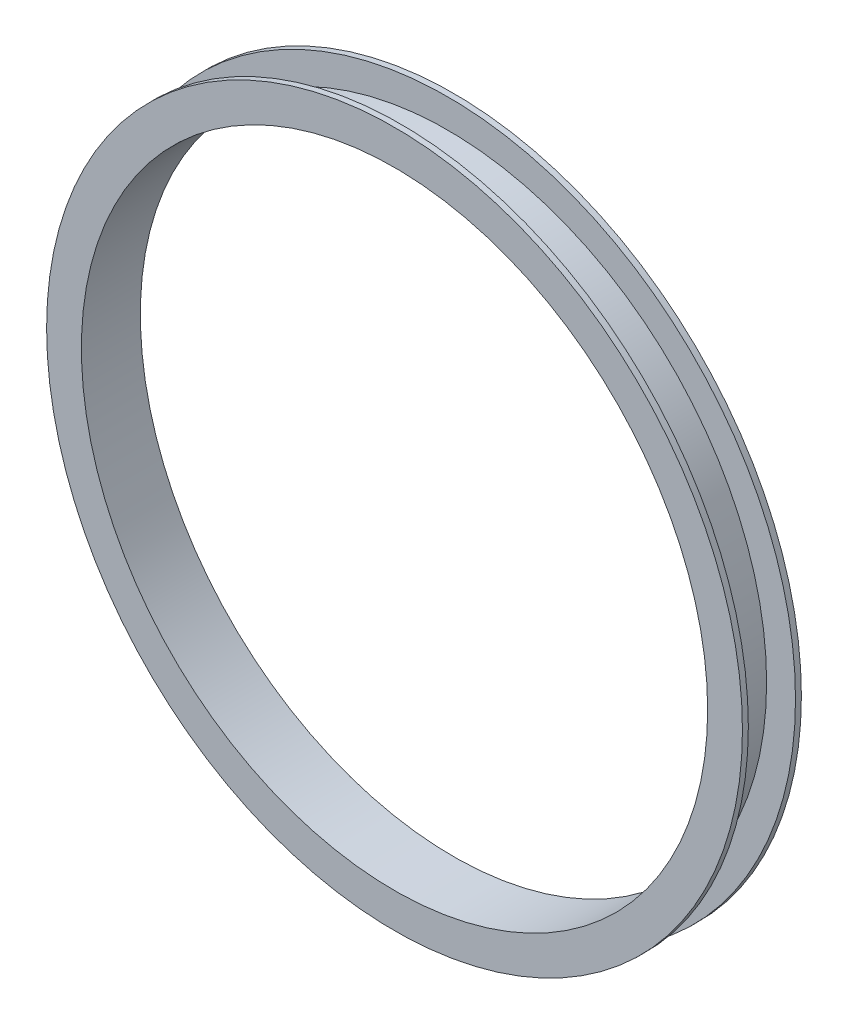
ISO-10303-21;
HEADER;
FILE_DESCRIPTION(('STEP AP214'),'2;1');
FILE_NAME('part.step','',(''),(''),'','','');
FILE_SCHEMA(('AUTOMOTIVE_DESIGN { 1 0 10303 214 1 1 1 1 }'));
ENDSEC;
DATA;
#1=APPLICATION_CONTEXT('core data for automotive mechanical design processes');
#2=APPLICATION_PROTOCOL_DEFINITION('international standard','automotive_design',2000,#1);
#3=PRODUCT_CONTEXT('',#1,'mechanical');
#4=PRODUCT('Part','Part','',(#3));
#5=PRODUCT_RELATED_PRODUCT_CATEGORY('part','',(#4));
#6=PRODUCT_DEFINITION_FORMATION('','',#4);
#7=PRODUCT_DEFINITION_CONTEXT('part definition',#1,'design');
#8=PRODUCT_DEFINITION('design','',#6,#7);
#9=PRODUCT_DEFINITION_SHAPE('','',#8);
#10=(LENGTH_UNIT() NAMED_UNIT(*) SI_UNIT(.MILLI.,.METRE.));
#11=(NAMED_UNIT(*) PLANE_ANGLE_UNIT() SI_UNIT($,.RADIAN.));
#12=(NAMED_UNIT(*) SI_UNIT($,.STERADIAN.) SOLID_ANGLE_UNIT());
#13=UNCERTAINTY_MEASURE_WITH_UNIT(LENGTH_MEASURE(1.E-05),#10,'distance_accuracy_value','');
#14=(GEOMETRIC_REPRESENTATION_CONTEXT(3) GLOBAL_UNCERTAINTY_ASSIGNED_CONTEXT((#13)) GLOBAL_UNIT_ASSIGNED_CONTEXT((#10,
#11,#12)) REPRESENTATION_CONTEXT('',''));
#15=CARTESIAN_POINT('',(0.,0.,0.));
#16=DIRECTION('',(0.,0.,1.));
#17=DIRECTION('',(1.,0.,0.));
#18=AXIS2_PLACEMENT_3D('',#15,#16,#17);
#19=CARTESIAN_POINT('',(0.,0.,3.175));
#20=DIRECTION('',(0.,0.,1.));
#21=DIRECTION('',(1.,0.,0.));
#22=AXIS2_PLACEMENT_3D('',#19,#20,#21);
#23=PLANE('',#22);
#24=CARTESIAN_POINT('',(0.,0.,3.175));
#25=DIRECTION('',(0.,0.,1.));
#26=DIRECTION('',(1.,0.,0.));
#27=AXIS2_PLACEMENT_3D('',#24,#25,#26);
#28=CIRCLE('',#27,187.3885);
#29=CARTESIAN_POINT('',(187.3885,0.,3.175));
#30=VERTEX_POINT('',#29);
#31=EDGE_CURVE('E10',#30,#30,#28,.T.);
#32=ORIENTED_EDGE('',*,*,#31,.T.);
#33=EDGE_LOOP('',(#32));
#34=FACE_BOUND('',#33,.T.);
#35=CARTESIAN_POINT('',(0.,0.,3.175));
#36=DIRECTION('',(0.,0.,1.));
#37=DIRECTION('',(1.,0.,0.));
#38=AXIS2_PLACEMENT_3D('',#35,#36,#37);
#39=CIRCLE('',#38,171.831);
#40=CARTESIAN_POINT('',(171.831,0.,3.175));
#41=VERTEX_POINT('',#40);
#42=EDGE_CURVE('E48',#41,#41,#39,.T.);
#43=ORIENTED_EDGE('',*,*,#42,.F.);
#44=EDGE_LOOP('',(#43));
#45=FACE_BOUND('',#44,.T.);
#46=ADVANCED_FACE('F32',(#34,#45),#23,.T.);
#47=CARTESIAN_POINT('',(0.,0.,0.));
#48=DIRECTION('',(0.,0.,1.));
#49=DIRECTION('',(1.,0.,0.));
#50=AXIS2_PLACEMENT_3D('',#47,#48,#49);
#51=PLANE('',#50);
#52=CARTESIAN_POINT('',(0.,0.,0.));
#53=DIRECTION('',(0.,0.,1.));
#54=DIRECTION('',(1.,0.,0.));
#55=AXIS2_PLACEMENT_3D('',#52,#53,#54);
#56=CIRCLE('',#55,187.3885);
#57=CARTESIAN_POINT('',(187.3885,0.,0.));
#58=VERTEX_POINT('',#57);
#59=EDGE_CURVE('E36',#58,#58,#56,.T.);
#60=ORIENTED_EDGE('',*,*,#59,.F.);
#61=EDGE_LOOP('',(#60));
#62=FACE_BOUND('',#61,.T.);
#63=CARTESIAN_POINT('',(0.,0.,0.));
#64=DIRECTION('',(0.,0.,1.));
#65=DIRECTION('',(1.,0.,0.));
#66=AXIS2_PLACEMENT_3D('',#63,#64,#65);
#67=CIRCLE('',#66,168.656);
#68=CARTESIAN_POINT('',(168.656,0.,0.));
#69=VERTEX_POINT('',#68);
#70=EDGE_CURVE('E43',#69,#69,#67,.T.);
#71=ORIENTED_EDGE('',*,*,#70,.T.);
#72=EDGE_LOOP('',(#71));
#73=FACE_BOUND('',#72,.T.);
#74=ADVANCED_FACE('F81',(#62,#73),#51,.F.);
#75=CARTESIAN_POINT('',(0.,0.,3.175));
#76=DIRECTION('',(0.,0.,-1.));
#77=DIRECTION('',(-1.,0.,0.));
#78=AXIS2_PLACEMENT_3D('',#75,#76,#77);
#79=CYLINDRICAL_SURFACE('',#78,187.3885);
#80=ORIENTED_EDGE('',*,*,#31,.F.);
#81=EDGE_LOOP('',(#80));
#82=FACE_BOUND('',#81,.T.);
#83=ORIENTED_EDGE('',*,*,#59,.T.);
#84=EDGE_LOOP('',(#83));
#85=FACE_BOUND('',#84,.T.);
#86=ADVANCED_FACE('F34',(#82,#85),#79,.T.);
#87=CARTESIAN_POINT('',(0.,0.,3.175));
#88=DIRECTION('',(0.,0.,-1.));
#89=DIRECTION('',(-1.,0.,0.));
#90=AXIS2_PLACEMENT_3D('',#87,#88,#89);
#91=CYLINDRICAL_SURFACE('',#90,168.656);
#92=ORIENTED_EDGE('',*,*,#70,.F.);
#93=EDGE_LOOP('',(#92));
#94=FACE_BOUND('',#93,.T.);
#95=CARTESIAN_POINT('',(0.,0.,31.75));
#96=DIRECTION('',(0.,0.,1.));
#97=DIRECTION('',(1.,0.,0.));
#98=AXIS2_PLACEMENT_3D('',#95,#96,#97);
#99=CIRCLE('',#98,168.656);
#100=CARTESIAN_POINT('',(168.656,0.,31.75));
#101=VERTEX_POINT('',#100);
#102=EDGE_CURVE('E57',#101,#101,#99,.T.);
#103=ORIENTED_EDGE('',*,*,#102,.T.);
#104=EDGE_LOOP('',(#103));
#105=FACE_BOUND('',#104,.T.);
#106=ADVANCED_FACE('F63',(#94,#105),#91,.F.);
#107=CARTESIAN_POINT('',(0.,0.,28.575));
#108=DIRECTION('',(0.,0.,-1.));
#109=DIRECTION('',(-1.,0.,0.));
#110=AXIS2_PLACEMENT_3D('',#107,#108,#109);
#111=CYLINDRICAL_SURFACE('',#110,171.831);
#112=CARTESIAN_POINT('',(0.,0.,28.575));
#113=DIRECTION('',(0.,0.,1.));
#114=DIRECTION('',(1.,0.,0.));
#115=AXIS2_PLACEMENT_3D('',#112,#113,#114);
#116=CIRCLE('',#115,171.831);
#117=CARTESIAN_POINT('',(171.831,0.,28.575));
#118=VERTEX_POINT('',#117);
#119=EDGE_CURVE('E47',#118,#118,#116,.T.);
#120=ORIENTED_EDGE('',*,*,#119,.F.);
#121=EDGE_LOOP('',(#120));
#122=FACE_BOUND('',#121,.T.);
#123=ORIENTED_EDGE('',*,*,#42,.T.);
#124=EDGE_LOOP('',(#123));
#125=FACE_BOUND('',#124,.T.);
#126=ADVANCED_FACE('F68',(#122,#125),#111,.T.);
#127=CARTESIAN_POINT('',(0.,0.,31.75));
#128=DIRECTION('',(0.,0.,1.));
#129=DIRECTION('',(1.,0.,0.));
#130=AXIS2_PLACEMENT_3D('',#127,#128,#129);
#131=PLANE('',#130);
#132=CARTESIAN_POINT('',(0.,0.,31.75));
#133=DIRECTION('',(0.,0.,1.));
#134=DIRECTION('',(1.,0.,0.));
#135=AXIS2_PLACEMENT_3D('',#132,#133,#134);
#136=CIRCLE('',#135,187.3885);
#137=CARTESIAN_POINT('',(187.3885,0.,31.75));
#138=VERTEX_POINT('',#137);
#139=EDGE_CURVE('E51',#138,#138,#136,.T.);
#140=ORIENTED_EDGE('',*,*,#139,.T.);
#141=EDGE_LOOP('',(#140));
#142=FACE_BOUND('',#141,.T.);
#143=ORIENTED_EDGE('',*,*,#102,.F.);
#144=EDGE_LOOP('',(#143));
#145=FACE_BOUND('',#144,.T.);
#146=ADVANCED_FACE('F65',(#142,#145),#131,.T.);
#147=CARTESIAN_POINT('',(0.,0.,28.575));
#148=DIRECTION('',(0.,0.,1.));
#149=DIRECTION('',(1.,0.,0.));
#150=AXIS2_PLACEMENT_3D('',#147,#148,#149);
#151=PLANE('',#150);
#152=ORIENTED_EDGE('',*,*,#119,.T.);
#153=EDGE_LOOP('',(#152));
#154=FACE_BOUND('',#153,.T.);
#155=CARTESIAN_POINT('',(0.,0.,28.575));
#156=DIRECTION('',(0.,0.,1.));
#157=DIRECTION('',(1.,0.,0.));
#158=AXIS2_PLACEMENT_3D('',#155,#156,#157);
#159=CIRCLE('',#158,187.3885);
#160=CARTESIAN_POINT('',(187.3885,0.,28.575));
#161=VERTEX_POINT('',#160);
#162=EDGE_CURVE('E54',#161,#161,#159,.T.);
#163=ORIENTED_EDGE('',*,*,#162,.F.);
#164=EDGE_LOOP('',(#163));
#165=FACE_BOUND('',#164,.T.);
#166=ADVANCED_FACE('F67',(#154,#165),#151,.F.);
#167=CARTESIAN_POINT('',(0.,0.,31.75));
#168=DIRECTION('',(0.,0.,-1.));
#169=DIRECTION('',(-1.,0.,0.));
#170=AXIS2_PLACEMENT_3D('',#167,#168,#169);
#171=CYLINDRICAL_SURFACE('',#170,187.3885);
#172=ORIENTED_EDGE('',*,*,#139,.F.);
#173=EDGE_LOOP('',(#172));
#174=FACE_BOUND('',#173,.T.);
#175=ORIENTED_EDGE('',*,*,#162,.T.);
#176=EDGE_LOOP('',(#175));
#177=FACE_BOUND('',#176,.T.);
#178=ADVANCED_FACE('F75',(#174,#177),#171,.T.);
#179=CLOSED_SHELL('',(#46,#74,#86,#106,#126,#146,#166,#178));
#180=MANIFOLD_SOLID_BREP('B2',#179);
#181=ADVANCED_BREP_SHAPE_REPRESENTATION('',(#18,#180),#14);
#182=SHAPE_DEFINITION_REPRESENTATION(#9,#181);
ENDSEC;
END-ISO-10303-21;
